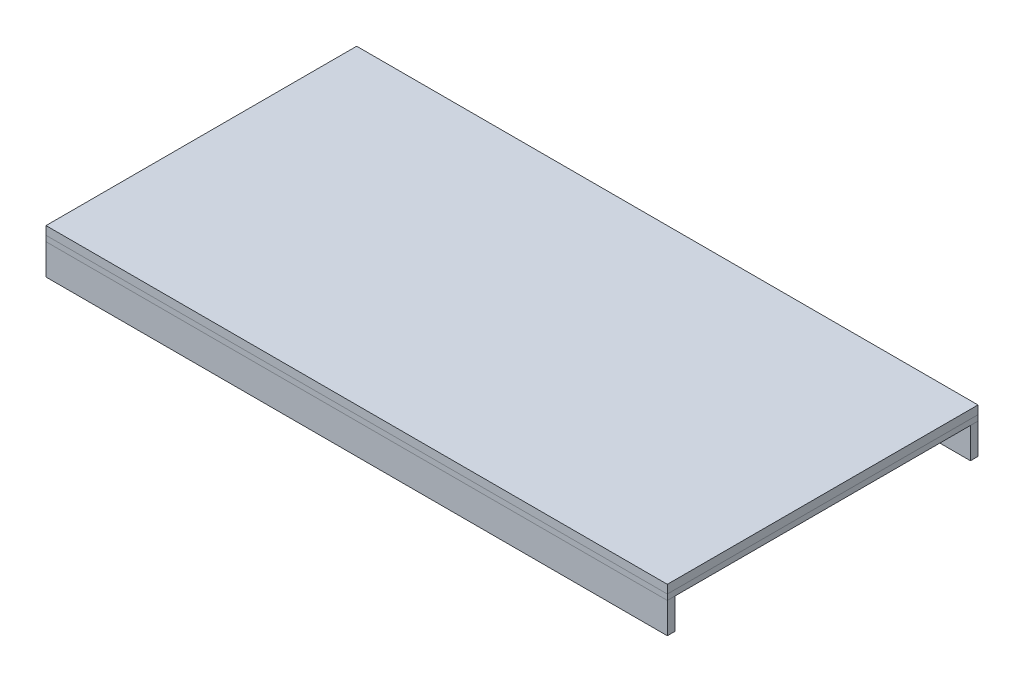
ISO-10303-21;
HEADER;
FILE_DESCRIPTION(('STEP AP214'),'2;1');
FILE_NAME('part.step','',(''),(''),'','','');
FILE_SCHEMA(('AUTOMOTIVE_DESIGN { 1 0 10303 214 1 1 1 1 }'));
ENDSEC;
DATA;
#1=APPLICATION_CONTEXT('core data for automotive mechanical design processes');
#2=APPLICATION_PROTOCOL_DEFINITION('international standard','automotive_design',2000,#1);
#3=PRODUCT_CONTEXT('',#1,'mechanical');
#4=PRODUCT('Part','Part','',(#3));
#5=PRODUCT_RELATED_PRODUCT_CATEGORY('part','',(#4));
#6=PRODUCT_DEFINITION_FORMATION('','',#4);
#7=PRODUCT_DEFINITION_CONTEXT('part definition',#1,'design');
#8=PRODUCT_DEFINITION('design','',#6,#7);
#9=PRODUCT_DEFINITION_SHAPE('','',#8);
#10=(LENGTH_UNIT() NAMED_UNIT(*) SI_UNIT(.MILLI.,.METRE.));
#11=(NAMED_UNIT(*) PLANE_ANGLE_UNIT() SI_UNIT($,.RADIAN.));
#12=(NAMED_UNIT(*) SI_UNIT($,.STERADIAN.) SOLID_ANGLE_UNIT());
#13=UNCERTAINTY_MEASURE_WITH_UNIT(LENGTH_MEASURE(1.E-05),#10,'distance_accuracy_value','');
#14=(GEOMETRIC_REPRESENTATION_CONTEXT(3) GLOBAL_UNCERTAINTY_ASSIGNED_CONTEXT((#13)) GLOBAL_UNIT_ASSIGNED_CONTEXT((#10,
#11,#12)) REPRESENTATION_CONTEXT('',''));
#15=CARTESIAN_POINT('',(0.,0.,0.));
#16=DIRECTION('',(0.,0.,1.));
#17=DIRECTION('',(1.,0.,0.));
#18=AXIS2_PLACEMENT_3D('',#15,#16,#17);
#19=CARTESIAN_POINT('',(-343.75,-100.5,-333.));
#20=DIRECTION('',(0.,0.,-1.));
#21=DIRECTION('',(-1.,0.,0.));
#22=AXIS2_PLACEMENT_3D('',#19,#20,#21);
#23=PLANE('',#22);
#24=DIRECTION('',(0.,1.,0.));
#25=VECTOR('',#24,1.);
#26=CARTESIAN_POINT('',(-343.75,-31.5,-333.));
#27=LINE('',#26,#25);
#28=CARTESIAN_POINT('',(-343.75,-100.5,-333.));
#29=VERTEX_POINT('',#28);
#30=CARTESIAN_POINT('',(-343.75,-31.5,-333.));
#31=VERTEX_POINT('',#30);
#32=EDGE_CURVE('E96',#29,#31,#27,.T.);
#33=ORIENTED_EDGE('',*,*,#32,.F.);
#34=DIRECTION('',(1.,0.,0.));
#35=VECTOR('',#34,1.);
#36=CARTESIAN_POINT('',(-343.75,-100.5,-333.));
#37=LINE('',#36,#35);
#38=CARTESIAN_POINT('',(-356.25,-100.5,-333.));
#39=VERTEX_POINT('',#38);
#40=EDGE_CURVE('E107',#39,#29,#37,.T.);
#41=ORIENTED_EDGE('',*,*,#40,.F.);
#42=DIRECTION('',(0.,-1.,0.));
#43=VECTOR('',#42,1.);
#44=CARTESIAN_POINT('',(-356.25,-31.5,-333.));
#45=LINE('',#44,#43);
#46=CARTESIAN_POINT('',(-356.25,-31.5,-333.));
#47=VERTEX_POINT('',#46);
#48=EDGE_CURVE('E98',#47,#39,#45,.T.);
#49=ORIENTED_EDGE('',*,*,#48,.F.);
#50=DIRECTION('',(-1.,0.,0.));
#51=VECTOR('',#50,1.);
#52=CARTESIAN_POINT('',(-343.75,-31.5,-333.));
#53=LINE('',#52,#51);
#54=EDGE_CURVE('E88',#31,#47,#53,.T.);
#55=ORIENTED_EDGE('',*,*,#54,.F.);
#56=EDGE_LOOP('',(#33,#41,#49,#55));
#57=FACE_BOUND('',#56,.T.);
#58=ADVANCED_FACE('F47',(#57),#23,.T.);
#59=CARTESIAN_POINT('',(-343.75,-100.5,403.12310603503));
#60=DIRECTION('',(0.,1.,0.));
#61=DIRECTION('',(-1.,0.,0.));
#62=AXIS2_PLACEMENT_3D('',#59,#60,#61);
#63=PLANE('',#62);
#64=DIRECTION('',(0.,0.,-1.));
#65=VECTOR('',#64,1.);
#66=CARTESIAN_POINT('',(-343.75,-100.5,403.12310603503));
#67=LINE('',#66,#65);
#68=CARTESIAN_POINT('',(-343.75,-100.5,333.));
#69=VERTEX_POINT('',#68);
#70=EDGE_CURVE('E101',#69,#29,#67,.T.);
#71=ORIENTED_EDGE('',*,*,#70,.F.);
#72=DIRECTION('',(-1.,0.,0.));
#73=VECTOR('',#72,1.);
#74=CARTESIAN_POINT('',(-343.75,-100.5,333.));
#75=LINE('',#74,#73);
#76=CARTESIAN_POINT('',(-356.25,-100.5,333.));
#77=VERTEX_POINT('',#76);
#78=EDGE_CURVE('E51',#69,#77,#75,.T.);
#79=ORIENTED_EDGE('',*,*,#78,.T.);
#80=DIRECTION('',(0.,0.,-1.));
#81=VECTOR('',#80,1.);
#82=CARTESIAN_POINT('',(-356.25,-100.5,403.12310603503));
#83=LINE('',#82,#81);
#84=EDGE_CURVE('E110',#77,#39,#83,.T.);
#85=ORIENTED_EDGE('',*,*,#84,.T.);
#86=ORIENTED_EDGE('',*,*,#40,.T.);
#87=EDGE_LOOP('',(#71,#79,#85,#86));
#88=FACE_BOUND('',#87,.T.);
#89=ADVANCED_FACE('F120',(#88),#63,.F.);
#90=CARTESIAN_POINT('',(-356.25,-31.5,403.12310603503));
#91=DIRECTION('',(1.,0.,0.));
#92=DIRECTION('',(0.,0.,-1.));
#93=AXIS2_PLACEMENT_3D('',#90,#91,#92);
#94=PLANE('',#93);
#95=ORIENTED_EDGE('',*,*,#84,.F.);
#96=DIRECTION('',(0.,1.,0.));
#97=VECTOR('',#96,1.);
#98=CARTESIAN_POINT('',(-356.25,-31.5,333.));
#99=LINE('',#98,#97);
#100=CARTESIAN_POINT('',(-356.25,-31.5,333.));
#101=VERTEX_POINT('',#100);
#102=EDGE_CURVE('E116',#77,#101,#99,.T.);
#103=ORIENTED_EDGE('',*,*,#102,.T.);
#104=DIRECTION('',(0.,0.,-1.));
#105=VECTOR('',#104,1.);
#106=CARTESIAN_POINT('',(-356.25,-31.5,403.12310603503));
#107=LINE('',#106,#105);
#108=EDGE_CURVE('E92',#101,#47,#107,.T.);
#109=ORIENTED_EDGE('',*,*,#108,.T.);
#110=ORIENTED_EDGE('',*,*,#48,.T.);
#111=EDGE_LOOP('',(#95,#103,#109,#110));
#112=FACE_BOUND('',#111,.T.);
#113=ADVANCED_FACE('F115',(#112),#94,.F.);
#114=CARTESIAN_POINT('',(-343.75,-31.5,403.12310603503));
#115=DIRECTION('',(0.,-1.,0.));
#116=DIRECTION('',(1.,0.,0.));
#117=AXIS2_PLACEMENT_3D('',#114,#115,#116);
#118=PLANE('',#117);
#119=ORIENTED_EDGE('',*,*,#108,.F.);
#120=DIRECTION('',(1.,0.,0.));
#121=VECTOR('',#120,1.);
#122=CARTESIAN_POINT('',(-343.75,-31.5,333.));
#123=LINE('',#122,#121);
#124=CARTESIAN_POINT('',(-343.75,-31.5,333.));
#125=VERTEX_POINT('',#124);
#126=EDGE_CURVE('E56',#101,#125,#123,.T.);
#127=ORIENTED_EDGE('',*,*,#126,.T.);
#128=DIRECTION('',(0.,0.,-1.));
#129=VECTOR('',#128,1.);
#130=CARTESIAN_POINT('',(-343.75,-31.5,403.12310603503));
#131=LINE('',#130,#129);
#132=EDGE_CURVE('E85',#125,#31,#131,.T.);
#133=ORIENTED_EDGE('',*,*,#132,.T.);
#134=ORIENTED_EDGE('',*,*,#54,.T.);
#135=EDGE_LOOP('',(#119,#127,#133,#134));
#136=FACE_BOUND('',#135,.T.);
#137=ADVANCED_FACE('F87',(#136),#118,.F.);
#138=CARTESIAN_POINT('',(-343.75,-31.5,403.12310603503));
#139=DIRECTION('',(-1.,0.,0.));
#140=DIRECTION('',(0.,0.,1.));
#141=AXIS2_PLACEMENT_3D('',#138,#139,#140);
#142=PLANE('',#141);
#143=ORIENTED_EDGE('',*,*,#132,.F.);
#144=DIRECTION('',(0.,-1.,0.));
#145=VECTOR('',#144,1.);
#146=CARTESIAN_POINT('',(-343.75,-31.5,333.));
#147=LINE('',#146,#145);
#148=EDGE_CURVE('E12',#125,#69,#147,.T.);
#149=ORIENTED_EDGE('',*,*,#148,.T.);
#150=ORIENTED_EDGE('',*,*,#70,.T.);
#151=ORIENTED_EDGE('',*,*,#32,.T.);
#152=EDGE_LOOP('',(#143,#149,#150,#151));
#153=FACE_BOUND('',#152,.T.);
#154=ADVANCED_FACE('F49',(#153),#142,.F.);
#155=CARTESIAN_POINT('',(-771.063352017759,-31.5,333.));
#156=DIRECTION('',(0.,0.,-1.));
#157=DIRECTION('',(-1.,0.,0.));
#158=AXIS2_PLACEMENT_3D('',#155,#156,#157);
#159=PLANE('',#158);
#160=ORIENTED_EDGE('',*,*,#126,.F.);
#161=ORIENTED_EDGE('',*,*,#102,.F.);
#162=ORIENTED_EDGE('',*,*,#78,.F.);
#163=ORIENTED_EDGE('',*,*,#148,.F.);
#164=EDGE_LOOP('',(#160,#161,#162,#163));
#165=FACE_BOUND('',#164,.T.);
#166=ADVANCED_FACE('F121',(#165),#159,.F.);
#167=CLOSED_SHELL('',(#58,#89,#113,#137,#154,#166));
#168=MANIFOLD_SOLID_BREP('B2',#167);
#169=CARTESIAN_POINT('',(343.75,-100.5,-333.));
#170=DIRECTION('',(0.,0.,1.));
#171=DIRECTION('',(1.,0.,0.));
#172=AXIS2_PLACEMENT_3D('',#169,#170,#171);
#173=PLANE('',#172);
#174=DIRECTION('',(0.,-1.,0.));
#175=VECTOR('',#174,1.);
#176=CARTESIAN_POINT('',(343.75,-31.5,-333.));
#177=LINE('',#176,#175);
#178=CARTESIAN_POINT('',(343.75,-31.5,-333.));
#179=VERTEX_POINT('',#178);
#180=CARTESIAN_POINT('',(343.75,-100.5,-333.));
#181=VERTEX_POINT('',#180);
#182=EDGE_CURVE('E229',#179,#181,#177,.T.);
#183=ORIENTED_EDGE('',*,*,#182,.F.);
#184=DIRECTION('',(-1.,0.,0.));
#185=VECTOR('',#184,1.);
#186=CARTESIAN_POINT('',(343.75,-31.5,-333.));
#187=LINE('',#186,#185);
#188=CARTESIAN_POINT('',(356.25,-31.5,-333.));
#189=VERTEX_POINT('',#188);
#190=EDGE_CURVE('E240',#189,#179,#187,.T.);
#191=ORIENTED_EDGE('',*,*,#190,.F.);
#192=DIRECTION('',(0.,1.,0.));
#193=VECTOR('',#192,1.);
#194=CARTESIAN_POINT('',(356.25,-31.5,-333.));
#195=LINE('',#194,#193);
#196=CARTESIAN_POINT('',(356.25,-100.5,-333.));
#197=VERTEX_POINT('',#196);
#198=EDGE_CURVE('E231',#197,#189,#195,.T.);
#199=ORIENTED_EDGE('',*,*,#198,.F.);
#200=DIRECTION('',(1.,0.,0.));
#201=VECTOR('',#200,1.);
#202=CARTESIAN_POINT('',(343.75,-100.5,-333.));
#203=LINE('',#202,#201);
#204=EDGE_CURVE('E221',#181,#197,#203,.T.);
#205=ORIENTED_EDGE('',*,*,#204,.F.);
#206=EDGE_LOOP('',(#183,#191,#199,#205));
#207=FACE_BOUND('',#206,.T.);
#208=ADVANCED_FACE('F180',(#207),#173,.F.);
#209=CARTESIAN_POINT('',(343.75,-31.5,403.12310603503));
#210=DIRECTION('',(0.,-1.,0.));
#211=DIRECTION('',(0.,0.,-1.));
#212=AXIS2_PLACEMENT_3D('',#209,#210,#211);
#213=PLANE('',#212);
#214=DIRECTION('',(0.,0.,-1.));
#215=VECTOR('',#214,1.);
#216=CARTESIAN_POINT('',(343.75,-31.5,403.12310603503));
#217=LINE('',#216,#215);
#218=CARTESIAN_POINT('',(343.75,-31.5,333.));
#219=VERTEX_POINT('',#218);
#220=EDGE_CURVE('E234',#219,#179,#217,.T.);
#221=ORIENTED_EDGE('',*,*,#220,.F.);
#222=DIRECTION('',(1.,0.,0.));
#223=VECTOR('',#222,1.);
#224=CARTESIAN_POINT('',(343.75,-31.5,333.));
#225=LINE('',#224,#223);
#226=CARTESIAN_POINT('',(356.25,-31.5,333.));
#227=VERTEX_POINT('',#226);
#228=EDGE_CURVE('E184',#219,#227,#225,.T.);
#229=ORIENTED_EDGE('',*,*,#228,.T.);
#230=DIRECTION('',(0.,0.,-1.));
#231=VECTOR('',#230,1.);
#232=CARTESIAN_POINT('',(356.25,-31.5,403.12310603503));
#233=LINE('',#232,#231);
#234=EDGE_CURVE('E243',#227,#189,#233,.T.);
#235=ORIENTED_EDGE('',*,*,#234,.T.);
#236=ORIENTED_EDGE('',*,*,#190,.T.);
#237=EDGE_LOOP('',(#221,#229,#235,#236));
#238=FACE_BOUND('',#237,.T.);
#239=ADVANCED_FACE('F253',(#238),#213,.F.);
#240=CARTESIAN_POINT('',(356.25,-31.5,403.12310603503));
#241=DIRECTION('',(-1.,0.,0.));
#242=DIRECTION('',(0.,-1.,0.));
#243=AXIS2_PLACEMENT_3D('',#240,#241,#242);
#244=PLANE('',#243);
#245=ORIENTED_EDGE('',*,*,#234,.F.);
#246=DIRECTION('',(0.,-1.,0.));
#247=VECTOR('',#246,1.);
#248=CARTESIAN_POINT('',(356.25,-31.5,333.));
#249=LINE('',#248,#247);
#250=CARTESIAN_POINT('',(356.25,-100.5,333.));
#251=VERTEX_POINT('',#250);
#252=EDGE_CURVE('E249',#227,#251,#249,.T.);
#253=ORIENTED_EDGE('',*,*,#252,.T.);
#254=DIRECTION('',(0.,0.,-1.));
#255=VECTOR('',#254,1.);
#256=CARTESIAN_POINT('',(356.25,-100.5,403.12310603503));
#257=LINE('',#256,#255);
#258=EDGE_CURVE('E225',#251,#197,#257,.T.);
#259=ORIENTED_EDGE('',*,*,#258,.T.);
#260=ORIENTED_EDGE('',*,*,#198,.T.);
#261=EDGE_LOOP('',(#245,#253,#259,#260));
#262=FACE_BOUND('',#261,.T.);
#263=ADVANCED_FACE('F248',(#262),#244,.F.);
#264=CARTESIAN_POINT('',(343.75,-100.5,403.12310603503));
#265=DIRECTION('',(0.,1.,0.));
#266=DIRECTION('',(0.,0.,1.));
#267=AXIS2_PLACEMENT_3D('',#264,#265,#266);
#268=PLANE('',#267);
#269=ORIENTED_EDGE('',*,*,#258,.F.);
#270=DIRECTION('',(-1.,0.,0.));
#271=VECTOR('',#270,1.);
#272=CARTESIAN_POINT('',(343.75,-100.5,333.));
#273=LINE('',#272,#271);
#274=CARTESIAN_POINT('',(343.75,-100.5,333.));
#275=VERTEX_POINT('',#274);
#276=EDGE_CURVE('E189',#251,#275,#273,.T.);
#277=ORIENTED_EDGE('',*,*,#276,.T.);
#278=DIRECTION('',(0.,0.,-1.));
#279=VECTOR('',#278,1.);
#280=CARTESIAN_POINT('',(343.75,-100.5,403.12310603503));
#281=LINE('',#280,#279);
#282=EDGE_CURVE('E218',#275,#181,#281,.T.);
#283=ORIENTED_EDGE('',*,*,#282,.T.);
#284=ORIENTED_EDGE('',*,*,#204,.T.);
#285=EDGE_LOOP('',(#269,#277,#283,#284));
#286=FACE_BOUND('',#285,.T.);
#287=ADVANCED_FACE('F220',(#286),#268,.F.);
#288=CARTESIAN_POINT('',(343.75,-31.5,403.12310603503));
#289=DIRECTION('',(1.,0.,0.));
#290=DIRECTION('',(0.,1.,0.));
#291=AXIS2_PLACEMENT_3D('',#288,#289,#290);
#292=PLANE('',#291);
#293=ORIENTED_EDGE('',*,*,#282,.F.);
#294=DIRECTION('',(0.,1.,0.));
#295=VECTOR('',#294,1.);
#296=CARTESIAN_POINT('',(343.75,-31.5,333.));
#297=LINE('',#296,#295);
#298=EDGE_CURVE('E45',#275,#219,#297,.T.);
#299=ORIENTED_EDGE('',*,*,#298,.T.);
#300=ORIENTED_EDGE('',*,*,#220,.T.);
#301=ORIENTED_EDGE('',*,*,#182,.T.);
#302=EDGE_LOOP('',(#293,#299,#300,#301));
#303=FACE_BOUND('',#302,.T.);
#304=ADVANCED_FACE('F182',(#303),#292,.F.);
#305=CARTESIAN_POINT('',(-771.063352017759,-31.5,333.));
#306=DIRECTION('',(0.,0.,-1.));
#307=DIRECTION('',(-1.,0.,0.));
#308=AXIS2_PLACEMENT_3D('',#305,#306,#307);
#309=PLANE('',#308);
#310=ORIENTED_EDGE('',*,*,#276,.F.);
#311=ORIENTED_EDGE('',*,*,#252,.F.);
#312=ORIENTED_EDGE('',*,*,#228,.F.);
#313=ORIENTED_EDGE('',*,*,#298,.F.);
#314=EDGE_LOOP('',(#310,#311,#312,#313));
#315=FACE_BOUND('',#314,.T.);
#316=ADVANCED_FACE('F254',(#315),#309,.F.);
#317=CLOSED_SHELL('',(#208,#239,#263,#287,#304,#316));
#318=MANIFOLD_SOLID_BREP('B6',#317);
#319=CARTESIAN_POINT('',(-6.24999999999999,-100.5,-333.));
#320=DIRECTION('',(0.,0.,1.));
#321=DIRECTION('',(1.,0.,0.));
#322=AXIS2_PLACEMENT_3D('',#319,#320,#321);
#323=PLANE('',#322);
#324=DIRECTION('',(0.,-1.,0.));
#325=VECTOR('',#324,1.);
#326=CARTESIAN_POINT('',(-6.25000000000003,-31.5,-333.));
#327=LINE('',#326,#325);
#328=CARTESIAN_POINT('',(-6.25000000000003,-31.5,-333.));
#329=VERTEX_POINT('',#328);
#330=CARTESIAN_POINT('',(-6.24999999999999,-100.5,-333.));
#331=VERTEX_POINT('',#330);
#332=EDGE_CURVE('E362',#329,#331,#327,.T.);
#333=ORIENTED_EDGE('',*,*,#332,.F.);
#334=DIRECTION('',(-1.,0.,0.));
#335=VECTOR('',#334,1.);
#336=CARTESIAN_POINT('',(-6.25000000000003,-31.5,-333.));
#337=LINE('',#336,#335);
#338=CARTESIAN_POINT('',(6.25,-31.5,-333.));
#339=VERTEX_POINT('',#338);
#340=EDGE_CURVE('E373',#339,#329,#337,.T.);
#341=ORIENTED_EDGE('',*,*,#340,.F.);
#342=DIRECTION('',(0.,1.,0.));
#343=VECTOR('',#342,1.);
#344=CARTESIAN_POINT('',(6.25,-31.5,-333.));
#345=LINE('',#344,#343);
#346=CARTESIAN_POINT('',(6.25000000000001,-100.5,-333.));
#347=VERTEX_POINT('',#346);
#348=EDGE_CURVE('E364',#347,#339,#345,.T.);
#349=ORIENTED_EDGE('',*,*,#348,.F.);
#350=DIRECTION('',(1.,0.,0.));
#351=VECTOR('',#350,1.);
#352=CARTESIAN_POINT('',(-6.24999999999999,-100.5,-333.));
#353=LINE('',#352,#351);
#354=EDGE_CURVE('E354',#331,#347,#353,.T.);
#355=ORIENTED_EDGE('',*,*,#354,.F.);
#356=EDGE_LOOP('',(#333,#341,#349,#355));
#357=FACE_BOUND('',#356,.T.);
#358=ADVANCED_FACE('F313',(#357),#323,.F.);
#359=CARTESIAN_POINT('',(-6.25000000000003,-31.5,403.12310603503));
#360=DIRECTION('',(0.,-1.,0.));
#361=DIRECTION('',(0.,0.,-1.));
#362=AXIS2_PLACEMENT_3D('',#359,#360,#361);
#363=PLANE('',#362);
#364=DIRECTION('',(0.,0.,-1.));
#365=VECTOR('',#364,1.);
#366=CARTESIAN_POINT('',(-6.25000000000003,-31.5,403.12310603503));
#367=LINE('',#366,#365);
#368=CARTESIAN_POINT('',(-6.25000000000003,-31.5,333.));
#369=VERTEX_POINT('',#368);
#370=EDGE_CURVE('E367',#369,#329,#367,.T.);
#371=ORIENTED_EDGE('',*,*,#370,.F.);
#372=DIRECTION('',(1.,0.,0.));
#373=VECTOR('',#372,1.);
#374=CARTESIAN_POINT('',(-6.25000000000004,-31.5,333.));
#375=LINE('',#374,#373);
#376=CARTESIAN_POINT('',(6.25,-31.5,333.));
#377=VERTEX_POINT('',#376);
#378=EDGE_CURVE('E317',#369,#377,#375,.T.);
#379=ORIENTED_EDGE('',*,*,#378,.T.);
#380=DIRECTION('',(0.,0.,-1.));
#381=VECTOR('',#380,1.);
#382=CARTESIAN_POINT('',(6.25,-31.5,403.12310603503));
#383=LINE('',#382,#381);
#384=EDGE_CURVE('E376',#377,#339,#383,.T.);
#385=ORIENTED_EDGE('',*,*,#384,.T.);
#386=ORIENTED_EDGE('',*,*,#340,.T.);
#387=EDGE_LOOP('',(#371,#379,#385,#386));
#388=FACE_BOUND('',#387,.T.);
#389=ADVANCED_FACE('F386',(#388),#363,.F.);
#390=CARTESIAN_POINT('',(6.25,-31.5,403.12310603503));
#391=DIRECTION('',(-1.,0.,0.));
#392=DIRECTION('',(0.,-1.,0.));
#393=AXIS2_PLACEMENT_3D('',#390,#391,#392);
#394=PLANE('',#393);
#395=ORIENTED_EDGE('',*,*,#384,.F.);
#396=DIRECTION('',(0.,-1.,0.));
#397=VECTOR('',#396,1.);
#398=CARTESIAN_POINT('',(6.25,-31.5,333.));
#399=LINE('',#398,#397);
#400=CARTESIAN_POINT('',(6.25000000000001,-100.5,333.));
#401=VERTEX_POINT('',#400);
#402=EDGE_CURVE('E382',#377,#401,#399,.T.);
#403=ORIENTED_EDGE('',*,*,#402,.T.);
#404=DIRECTION('',(0.,0.,-1.));
#405=VECTOR('',#404,1.);
#406=CARTESIAN_POINT('',(6.25000000000001,-100.5,403.12310603503));
#407=LINE('',#406,#405);
#408=EDGE_CURVE('E358',#401,#347,#407,.T.);
#409=ORIENTED_EDGE('',*,*,#408,.T.);
#410=ORIENTED_EDGE('',*,*,#348,.T.);
#411=EDGE_LOOP('',(#395,#403,#409,#410));
#412=FACE_BOUND('',#411,.T.);
#413=ADVANCED_FACE('F381',(#412),#394,.F.);
#414=CARTESIAN_POINT('',(-6.24999999999999,-100.5,403.12310603503));
#415=DIRECTION('',(0.,1.,0.));
#416=DIRECTION('',(0.,0.,1.));
#417=AXIS2_PLACEMENT_3D('',#414,#415,#416);
#418=PLANE('',#417);
#419=ORIENTED_EDGE('',*,*,#408,.F.);
#420=DIRECTION('',(-1.,0.,0.));
#421=VECTOR('',#420,1.);
#422=CARTESIAN_POINT('',(-6.25,-100.5,333.));
#423=LINE('',#422,#421);
#424=CARTESIAN_POINT('',(-6.24999999999999,-100.5,333.));
#425=VERTEX_POINT('',#424);
#426=EDGE_CURVE('E322',#401,#425,#423,.T.);
#427=ORIENTED_EDGE('',*,*,#426,.T.);
#428=DIRECTION('',(0.,0.,-1.));
#429=VECTOR('',#428,1.);
#430=CARTESIAN_POINT('',(-6.24999999999999,-100.5,403.12310603503));
#431=LINE('',#430,#429);
#432=EDGE_CURVE('E351',#425,#331,#431,.T.);
#433=ORIENTED_EDGE('',*,*,#432,.T.);
#434=ORIENTED_EDGE('',*,*,#354,.T.);
#435=EDGE_LOOP('',(#419,#427,#433,#434));
#436=FACE_BOUND('',#435,.T.);
#437=ADVANCED_FACE('F353',(#436),#418,.F.);
#438=CARTESIAN_POINT('',(-6.25000000000003,-31.5,403.12310603503));
#439=DIRECTION('',(1.,0.,0.));
#440=DIRECTION('',(0.,1.,0.));
#441=AXIS2_PLACEMENT_3D('',#438,#439,#440);
#442=PLANE('',#441);
#443=ORIENTED_EDGE('',*,*,#432,.F.);
#444=DIRECTION('',(0.,1.,0.));
#445=VECTOR('',#444,1.);
#446=CARTESIAN_POINT('',(-6.25000000000003,-31.5,333.));
#447=LINE('',#446,#445);
#448=EDGE_CURVE('E178',#425,#369,#447,.T.);
#449=ORIENTED_EDGE('',*,*,#448,.T.);
#450=ORIENTED_EDGE('',*,*,#370,.T.);
#451=ORIENTED_EDGE('',*,*,#332,.T.);
#452=EDGE_LOOP('',(#443,#449,#450,#451));
#453=FACE_BOUND('',#452,.T.);
#454=ADVANCED_FACE('F315',(#453),#442,.F.);
#455=CARTESIAN_POINT('',(-771.063352017759,-31.5,333.));
#456=DIRECTION('',(0.,0.,-1.));
#457=DIRECTION('',(-1.,0.,0.));
#458=AXIS2_PLACEMENT_3D('',#455,#456,#457);
#459=PLANE('',#458);
#460=ORIENTED_EDGE('',*,*,#426,.F.);
#461=ORIENTED_EDGE('',*,*,#402,.F.);
#462=ORIENTED_EDGE('',*,*,#378,.F.);
#463=ORIENTED_EDGE('',*,*,#448,.F.);
#464=EDGE_LOOP('',(#460,#461,#462,#463));
#465=FACE_BOUND('',#464,.T.);
#466=ADVANCED_FACE('F387',(#465),#459,.F.);
#467=CLOSED_SHELL('',(#358,#389,#413,#437,#454,#466));
#468=MANIFOLD_SOLID_BREP('B39',#467);
#469=CARTESIAN_POINT('',(-771.063352017759,-31.5,-350.));
#470=DIRECTION('',(0.,0.,-1.));
#471=DIRECTION('',(-1.,0.,0.));
#472=AXIS2_PLACEMENT_3D('',#469,#470,#471);
#473=PLANE('',#472);
#474=DIRECTION('',(0.,-1.,0.));
#475=VECTOR('',#474,1.);
#476=CARTESIAN_POINT('',(-700.,-31.5,-350.));
#477=LINE('',#476,#475);
#478=CARTESIAN_POINT('',(-700.,-31.5,-350.));
#479=VERTEX_POINT('',#478);
#480=CARTESIAN_POINT('',(-700.,-100.5,-350.));
#481=VERTEX_POINT('',#480);
#482=EDGE_CURVE('E454',#479,#481,#477,.T.);
#483=ORIENTED_EDGE('',*,*,#482,.F.);
#484=DIRECTION('',(1.,0.,0.));
#485=VECTOR('',#484,1.);
#486=CARTESIAN_POINT('',(-771.063352017759,-31.5,-350.));
#487=LINE('',#486,#485);
#488=CARTESIAN_POINT('',(700.,-31.5,-350.));
#489=VERTEX_POINT('',#488);
#490=EDGE_CURVE('E480',#479,#489,#487,.T.);
#491=ORIENTED_EDGE('',*,*,#490,.T.);
#492=DIRECTION('',(0.,1.,0.));
#493=VECTOR('',#492,1.);
#494=CARTESIAN_POINT('',(700.,-31.5,-350.));
#495=LINE('',#494,#493);
#496=CARTESIAN_POINT('',(700.,-100.5,-350.));
#497=VERTEX_POINT('',#496);
#498=EDGE_CURVE('E484',#497,#489,#495,.T.);
#499=ORIENTED_EDGE('',*,*,#498,.F.);
#500=DIRECTION('',(1.,0.,0.));
#501=VECTOR('',#500,1.);
#502=CARTESIAN_POINT('',(-771.063352017759,-100.5,-350.));
#503=LINE('',#502,#501);
#504=EDGE_CURVE('E506',#481,#497,#503,.T.);
#505=ORIENTED_EDGE('',*,*,#504,.F.);
#506=EDGE_LOOP('',(#483,#491,#499,#505));
#507=FACE_BOUND('',#506,.T.);
#508=ADVANCED_FACE('F446',(#507),#473,.T.);
#509=CARTESIAN_POINT('',(-771.063352017759,-100.5,-350.));
#510=DIRECTION('',(0.,-1.,0.));
#511=DIRECTION('',(0.,0.,-1.));
#512=AXIS2_PLACEMENT_3D('',#509,#510,#511);
#513=PLANE('',#512);
#514=DIRECTION('',(0.,0.,1.));
#515=VECTOR('',#514,1.);
#516=CARTESIAN_POINT('',(-700.,-100.5,-350.));
#517=LINE('',#516,#515);
#518=CARTESIAN_POINT('',(-700.,-100.5,-333.));
#519=VERTEX_POINT('',#518);
#520=EDGE_CURVE('E518',#481,#519,#517,.T.);
#521=ORIENTED_EDGE('',*,*,#520,.F.);
#522=ORIENTED_EDGE('',*,*,#504,.T.);
#523=DIRECTION('',(0.,0.,-1.));
#524=VECTOR('',#523,1.);
#525=CARTESIAN_POINT('',(700.,-100.5,-350.));
#526=LINE('',#525,#524);
#527=CARTESIAN_POINT('',(700.,-100.5,-333.));
#528=VERTEX_POINT('',#527);
#529=EDGE_CURVE('E488',#528,#497,#526,.T.);
#530=ORIENTED_EDGE('',*,*,#529,.F.);
#531=DIRECTION('',(1.,0.,0.));
#532=VECTOR('',#531,1.);
#533=CARTESIAN_POINT('',(-771.063352017759,-100.5,-333.));
#534=LINE('',#533,#532);
#535=EDGE_CURVE('E509',#519,#528,#534,.T.);
#536=ORIENTED_EDGE('',*,*,#535,.F.);
#537=EDGE_LOOP('',(#521,#522,#530,#536));
#538=FACE_BOUND('',#537,.T.);
#539=ADVANCED_FACE('F517',(#538),#513,.T.);
#540=CARTESIAN_POINT('',(-771.063352017759,-31.5,-333.));
#541=DIRECTION('',(0.,0.,1.));
#542=DIRECTION('',(1.,0.,0.));
#543=AXIS2_PLACEMENT_3D('',#540,#541,#542);
#544=PLANE('',#543);
#545=DIRECTION('',(0.,1.,0.));
#546=VECTOR('',#545,1.);
#547=CARTESIAN_POINT('',(-700.,-31.5,-333.));
#548=LINE('',#547,#546);
#549=CARTESIAN_POINT('',(-700.,-31.5,-333.));
#550=VERTEX_POINT('',#549);
#551=EDGE_CURVE('E508',#519,#550,#548,.T.);
#552=ORIENTED_EDGE('',*,*,#551,.F.);
#553=ORIENTED_EDGE('',*,*,#535,.T.);
#554=DIRECTION('',(0.,-1.,0.));
#555=VECTOR('',#554,1.);
#556=CARTESIAN_POINT('',(700.,-31.5,-333.));
#557=LINE('',#556,#555);
#558=CARTESIAN_POINT('',(700.,-31.5,-333.));
#559=VERTEX_POINT('',#558);
#560=EDGE_CURVE('E496',#559,#528,#557,.T.);
#561=ORIENTED_EDGE('',*,*,#560,.F.);
#562=DIRECTION('',(1.,0.,0.));
#563=VECTOR('',#562,1.);
#564=CARTESIAN_POINT('',(-771.063352017759,-31.5,-333.));
#565=LINE('',#564,#563);
#566=EDGE_CURVE('E487',#550,#559,#565,.T.);
#567=ORIENTED_EDGE('',*,*,#566,.F.);
#568=EDGE_LOOP('',(#552,#553,#561,#567));
#569=FACE_BOUND('',#568,.T.);
#570=ADVANCED_FACE('F514',(#569),#544,.T.);
#571=CARTESIAN_POINT('',(-771.063352017759,-31.5,-350.));
#572=DIRECTION('',(0.,1.,0.));
#573=DIRECTION('',(0.,0.,1.));
#574=AXIS2_PLACEMENT_3D('',#571,#572,#573);
#575=PLANE('',#574);
#576=DIRECTION('',(0.,0.,-1.));
#577=VECTOR('',#576,1.);
#578=CARTESIAN_POINT('',(-700.,-31.5,-350.));
#579=LINE('',#578,#577);
#580=EDGE_CURVE('E311',#550,#479,#579,.T.);
#581=ORIENTED_EDGE('',*,*,#580,.F.);
#582=ORIENTED_EDGE('',*,*,#566,.T.);
#583=DIRECTION('',(0.,0.,1.));
#584=VECTOR('',#583,1.);
#585=CARTESIAN_POINT('',(700.,-31.5,-350.));
#586=LINE('',#585,#584);
#587=EDGE_CURVE('E490',#489,#559,#586,.T.);
#588=ORIENTED_EDGE('',*,*,#587,.F.);
#589=ORIENTED_EDGE('',*,*,#490,.F.);
#590=EDGE_LOOP('',(#581,#582,#588,#589));
#591=FACE_BOUND('',#590,.T.);
#592=ADVANCED_FACE('F491',(#591),#575,.T.);
#593=CARTESIAN_POINT('',(700.,-100.5,-350.));
#594=DIRECTION('',(-1.,0.,0.));
#595=DIRECTION('',(0.,0.,1.));
#596=AXIS2_PLACEMENT_3D('',#593,#594,#595);
#597=PLANE('',#596);
#598=ORIENTED_EDGE('',*,*,#498,.T.);
#599=ORIENTED_EDGE('',*,*,#587,.T.);
#600=ORIENTED_EDGE('',*,*,#560,.T.);
#601=ORIENTED_EDGE('',*,*,#529,.T.);
#602=EDGE_LOOP('',(#598,#599,#600,#601));
#603=FACE_BOUND('',#602,.T.);
#604=ADVANCED_FACE('F498',(#603),#597,.F.);
#605=CARTESIAN_POINT('',(-700.,-31.5,350.));
#606=DIRECTION('',(1.,0.,0.));
#607=DIRECTION('',(0.,0.,-1.));
#608=AXIS2_PLACEMENT_3D('',#605,#606,#607);
#609=PLANE('',#608);
#610=ORIENTED_EDGE('',*,*,#482,.T.);
#611=ORIENTED_EDGE('',*,*,#520,.T.);
#612=ORIENTED_EDGE('',*,*,#551,.T.);
#613=ORIENTED_EDGE('',*,*,#580,.T.);
#614=EDGE_LOOP('',(#610,#611,#612,#613));
#615=FACE_BOUND('',#614,.T.);
#616=ADVANCED_FACE('F519',(#615),#609,.F.);
#617=CLOSED_SHELL('',(#508,#539,#570,#592,#604,#616));
#618=MANIFOLD_SOLID_BREP('B172',#617);
#619=CARTESIAN_POINT('',(-771.063352017759,-31.5,350.));
#620=DIRECTION('',(0.,0.,1.));
#621=DIRECTION('',(1.,0.,0.));
#622=AXIS2_PLACEMENT_3D('',#619,#620,#621);
#623=PLANE('',#622);
#624=DIRECTION('',(0.,1.,0.));
#625=VECTOR('',#624,1.);
#626=CARTESIAN_POINT('',(-700.,-31.5,350.));
#627=LINE('',#626,#625);
#628=CARTESIAN_POINT('',(-700.,-100.5,350.));
#629=VERTEX_POINT('',#628);
#630=CARTESIAN_POINT('',(-700.,-31.5,350.));
#631=VERTEX_POINT('',#630);
#632=EDGE_CURVE('E587',#629,#631,#627,.T.);
#633=ORIENTED_EDGE('',*,*,#632,.F.);
#634=DIRECTION('',(1.,0.,0.));
#635=VECTOR('',#634,1.);
#636=CARTESIAN_POINT('',(-771.063352017759,-100.5,350.));
#637=LINE('',#636,#635);
#638=CARTESIAN_POINT('',(700.,-100.5,350.));
#639=VERTEX_POINT('',#638);
#640=EDGE_CURVE('E613',#629,#639,#637,.T.);
#641=ORIENTED_EDGE('',*,*,#640,.T.);
#642=DIRECTION('',(0.,-1.,0.));
#643=VECTOR('',#642,1.);
#644=CARTESIAN_POINT('',(700.,-31.5,350.));
#645=LINE('',#644,#643);
#646=CARTESIAN_POINT('',(700.,-31.5,350.));
#647=VERTEX_POINT('',#646);
#648=EDGE_CURVE('E617',#647,#639,#645,.T.);
#649=ORIENTED_EDGE('',*,*,#648,.F.);
#650=DIRECTION('',(1.,0.,0.));
#651=VECTOR('',#650,1.);
#652=CARTESIAN_POINT('',(-771.063352017759,-31.5,350.));
#653=LINE('',#652,#651);
#654=EDGE_CURVE('E639',#631,#647,#653,.T.);
#655=ORIENTED_EDGE('',*,*,#654,.F.);
#656=EDGE_LOOP('',(#633,#641,#649,#655));
#657=FACE_BOUND('',#656,.T.);
#658=ADVANCED_FACE('F579',(#657),#623,.T.);
#659=CARTESIAN_POINT('',(-771.063352017759,-31.5,350.));
#660=DIRECTION('',(0.,1.,0.));
#661=DIRECTION('',(0.,0.,1.));
#662=AXIS2_PLACEMENT_3D('',#659,#660,#661);
#663=PLANE('',#662);
#664=DIRECTION('',(0.,0.,-1.));
#665=VECTOR('',#664,1.);
#666=CARTESIAN_POINT('',(-700.,-31.5,350.));
#667=LINE('',#666,#665);
#668=CARTESIAN_POINT('',(-700.,-31.5,333.));
#669=VERTEX_POINT('',#668);
#670=EDGE_CURVE('E651',#631,#669,#667,.T.);
#671=ORIENTED_EDGE('',*,*,#670,.F.);
#672=ORIENTED_EDGE('',*,*,#654,.T.);
#673=DIRECTION('',(0.,0.,1.));
#674=VECTOR('',#673,1.);
#675=CARTESIAN_POINT('',(700.,-31.5,350.));
#676=LINE('',#675,#674);
#677=CARTESIAN_POINT('',(700.,-31.5,333.));
#678=VERTEX_POINT('',#677);
#679=EDGE_CURVE('E621',#678,#647,#676,.T.);
#680=ORIENTED_EDGE('',*,*,#679,.F.);
#681=DIRECTION('',(1.,0.,0.));
#682=VECTOR('',#681,1.);
#683=CARTESIAN_POINT('',(-771.063352017759,-31.5,333.));
#684=LINE('',#683,#682);
#685=EDGE_CURVE('E642',#669,#678,#684,.T.);
#686=ORIENTED_EDGE('',*,*,#685,.F.);
#687=EDGE_LOOP('',(#671,#672,#680,#686));
#688=FACE_BOUND('',#687,.T.);
#689=ADVANCED_FACE('F650',(#688),#663,.T.);
#690=CARTESIAN_POINT('',(-771.063352017759,-31.5,333.));
#691=DIRECTION('',(0.,0.,-1.));
#692=DIRECTION('',(-1.,0.,0.));
#693=AXIS2_PLACEMENT_3D('',#690,#691,#692);
#694=PLANE('',#693);
#695=DIRECTION('',(0.,-1.,0.));
#696=VECTOR('',#695,1.);
#697=CARTESIAN_POINT('',(-700.,-31.5,333.));
#698=LINE('',#697,#696);
#699=CARTESIAN_POINT('',(-700.,-100.5,333.));
#700=VERTEX_POINT('',#699);
#701=EDGE_CURVE('E641',#669,#700,#698,.T.);
#702=ORIENTED_EDGE('',*,*,#701,.F.);
#703=ORIENTED_EDGE('',*,*,#685,.T.);
#704=DIRECTION('',(0.,1.,0.));
#705=VECTOR('',#704,1.);
#706=CARTESIAN_POINT('',(700.,-31.5,333.));
#707=LINE('',#706,#705);
#708=CARTESIAN_POINT('',(700.,-100.5,333.));
#709=VERTEX_POINT('',#708);
#710=EDGE_CURVE('E629',#709,#678,#707,.T.);
#711=ORIENTED_EDGE('',*,*,#710,.F.);
#712=DIRECTION('',(1.,0.,0.));
#713=VECTOR('',#712,1.);
#714=CARTESIAN_POINT('',(-771.063352017759,-100.5,333.));
#715=LINE('',#714,#713);
#716=EDGE_CURVE('E620',#700,#709,#715,.T.);
#717=ORIENTED_EDGE('',*,*,#716,.F.);
#718=EDGE_LOOP('',(#702,#703,#711,#717));
#719=FACE_BOUND('',#718,.T.);
#720=ADVANCED_FACE('F647',(#719),#694,.T.);
#721=CARTESIAN_POINT('',(-771.063352017759,-100.5,350.));
#722=DIRECTION('',(0.,-1.,0.));
#723=DIRECTION('',(0.,0.,-1.));
#724=AXIS2_PLACEMENT_3D('',#721,#722,#723);
#725=PLANE('',#724);
#726=DIRECTION('',(0.,0.,1.));
#727=VECTOR('',#726,1.);
#728=CARTESIAN_POINT('',(-700.,-100.5,350.));
#729=LINE('',#728,#727);
#730=EDGE_CURVE('E444',#700,#629,#729,.T.);
#731=ORIENTED_EDGE('',*,*,#730,.F.);
#732=ORIENTED_EDGE('',*,*,#716,.T.);
#733=DIRECTION('',(0.,0.,-1.));
#734=VECTOR('',#733,1.);
#735=CARTESIAN_POINT('',(700.,-100.5,350.));
#736=LINE('',#735,#734);
#737=EDGE_CURVE('E623',#639,#709,#736,.T.);
#738=ORIENTED_EDGE('',*,*,#737,.F.);
#739=ORIENTED_EDGE('',*,*,#640,.F.);
#740=EDGE_LOOP('',(#731,#732,#738,#739));
#741=FACE_BOUND('',#740,.T.);
#742=ADVANCED_FACE('F624',(#741),#725,.T.);
#743=CARTESIAN_POINT('',(700.,-100.5,350.));
#744=DIRECTION('',(1.,0.,0.));
#745=DIRECTION('',(0.,0.,-1.));
#746=AXIS2_PLACEMENT_3D('',#743,#744,#745);
#747=PLANE('',#746);
#748=ORIENTED_EDGE('',*,*,#648,.T.);
#749=ORIENTED_EDGE('',*,*,#737,.T.);
#750=ORIENTED_EDGE('',*,*,#710,.T.);
#751=ORIENTED_EDGE('',*,*,#679,.T.);
#752=EDGE_LOOP('',(#748,#749,#750,#751));
#753=FACE_BOUND('',#752,.T.);
#754=ADVANCED_FACE('F631',(#753),#747,.T.);
#755=CARTESIAN_POINT('',(-700.,-31.5,350.));
#756=DIRECTION('',(1.,0.,0.));
#757=DIRECTION('',(0.,0.,-1.));
#758=AXIS2_PLACEMENT_3D('',#755,#756,#757);
#759=PLANE('',#758);
#760=ORIENTED_EDGE('',*,*,#632,.T.);
#761=ORIENTED_EDGE('',*,*,#670,.T.);
#762=ORIENTED_EDGE('',*,*,#701,.T.);
#763=ORIENTED_EDGE('',*,*,#730,.T.);
#764=EDGE_LOOP('',(#760,#761,#762,#763));
#765=FACE_BOUND('',#764,.T.);
#766=ADVANCED_FACE('F652',(#765),#759,.F.);
#767=CLOSED_SHELL('',(#658,#689,#720,#742,#754,#766));
#768=MANIFOLD_SOLID_BREP('B305',#767);
#769=CARTESIAN_POINT('',(700.,-31.5,350.));
#770=DIRECTION('',(0.,0.,-1.));
#771=DIRECTION('',(-1.,0.,0.));
#772=AXIS2_PLACEMENT_3D('',#769,#770,#771);
#773=PLANE('',#772);
#774=DIRECTION('',(-1.,0.,0.));
#775=VECTOR('',#774,1.);
#776=CARTESIAN_POINT('',(700.,-19.,350.));
#777=LINE('',#776,#775);
#778=CARTESIAN_POINT('',(700.,-19.,350.));
#779=VERTEX_POINT('',#778);
#780=CARTESIAN_POINT('',(-700.,-19.,350.));
#781=VERTEX_POINT('',#780);
#782=EDGE_CURVE('E774',#779,#781,#777,.T.);
#783=ORIENTED_EDGE('',*,*,#782,.T.);
#784=DIRECTION('',(0.,1.,0.));
#785=VECTOR('',#784,1.);
#786=CARTESIAN_POINT('',(-700.,-31.5,350.));
#787=LINE('',#786,#785);
#788=CARTESIAN_POINT('',(-700.,-31.5,350.));
#789=VERTEX_POINT('',#788);
#790=EDGE_CURVE('E577',#789,#781,#787,.T.);
#791=ORIENTED_EDGE('',*,*,#790,.F.);
#792=DIRECTION('',(-1.,0.,0.));
#793=VECTOR('',#792,1.);
#794=CARTESIAN_POINT('',(700.,-31.5,350.));
#795=LINE('',#794,#793);
#796=CARTESIAN_POINT('',(700.,-31.5,350.));
#797=VERTEX_POINT('',#796);
#798=EDGE_CURVE('E762',#797,#789,#795,.T.);
#799=ORIENTED_EDGE('',*,*,#798,.F.);
#800=DIRECTION('',(0.,1.,0.));
#801=VECTOR('',#800,1.);
#802=CARTESIAN_POINT('',(700.,-31.5,350.));
#803=LINE('',#802,#801);
#804=EDGE_CURVE('E770',#797,#779,#803,.T.);
#805=ORIENTED_EDGE('',*,*,#804,.T.);
#806=EDGE_LOOP('',(#783,#791,#799,#805));
#807=FACE_BOUND('',#806,.T.);
#808=ADVANCED_FACE('F711',(#807),#773,.F.);
#809=CARTESIAN_POINT('',(-700.,-31.5,350.));
#810=DIRECTION('',(1.,0.,0.));
#811=DIRECTION('',(0.,0.,-1.));
#812=AXIS2_PLACEMENT_3D('',#809,#810,#811);
#813=PLANE('',#812);
#814=DIRECTION('',(0.,0.,-1.));
#815=VECTOR('',#814,1.);
#816=CARTESIAN_POINT('',(-700.,-19.,350.));
#817=LINE('',#816,#815);
#818=CARTESIAN_POINT('',(-700.,-19.,-350.));
#819=VERTEX_POINT('',#818);
#820=EDGE_CURVE('E766',#781,#819,#817,.T.);
#821=ORIENTED_EDGE('',*,*,#820,.T.);
#822=DIRECTION('',(0.,1.,0.));
#823=VECTOR('',#822,1.);
#824=CARTESIAN_POINT('',(-700.,-31.5,-350.));
#825=LINE('',#824,#823);
#826=CARTESIAN_POINT('',(-700.,-31.5,-350.));
#827=VERTEX_POINT('',#826);
#828=EDGE_CURVE('E719',#827,#819,#825,.T.);
#829=ORIENTED_EDGE('',*,*,#828,.F.);
#830=DIRECTION('',(0.,0.,-1.));
#831=VECTOR('',#830,1.);
#832=CARTESIAN_POINT('',(-700.,-31.5,350.));
#833=LINE('',#832,#831);
#834=EDGE_CURVE('E757',#789,#827,#833,.T.);
#835=ORIENTED_EDGE('',*,*,#834,.F.);
#836=ORIENTED_EDGE('',*,*,#790,.T.);
#837=EDGE_LOOP('',(#821,#829,#835,#836));
#838=FACE_BOUND('',#837,.T.);
#839=ADVANCED_FACE('F765',(#838),#813,.F.);
#840=CARTESIAN_POINT('',(-700.,-31.5,-350.));
#841=DIRECTION('',(0.,0.,1.));
#842=DIRECTION('',(1.,0.,0.));
#843=AXIS2_PLACEMENT_3D('',#840,#841,#842);
#844=PLANE('',#843);
#845=DIRECTION('',(1.,0.,0.));
#846=VECTOR('',#845,1.);
#847=CARTESIAN_POINT('',(-700.,-19.,-350.));
#848=LINE('',#847,#846);
#849=CARTESIAN_POINT('',(700.,-19.,-350.));
#850=VERTEX_POINT('',#849);
#851=EDGE_CURVE('E744',#819,#850,#848,.T.);
#852=ORIENTED_EDGE('',*,*,#851,.T.);
#853=DIRECTION('',(0.,1.,0.));
#854=VECTOR('',#853,1.);
#855=CARTESIAN_POINT('',(700.,-31.5,-350.));
#856=LINE('',#855,#854);
#857=CARTESIAN_POINT('',(700.,-31.5,-350.));
#858=VERTEX_POINT('',#857);
#859=EDGE_CURVE('E767',#858,#850,#856,.T.);
#860=ORIENTED_EDGE('',*,*,#859,.F.);
#861=DIRECTION('',(1.,0.,0.));
#862=VECTOR('',#861,1.);
#863=CARTESIAN_POINT('',(-700.,-31.5,-350.));
#864=LINE('',#863,#862);
#865=EDGE_CURVE('E760',#827,#858,#864,.T.);
#866=ORIENTED_EDGE('',*,*,#865,.F.);
#867=ORIENTED_EDGE('',*,*,#828,.T.);
#868=EDGE_LOOP('',(#852,#860,#866,#867));
#869=FACE_BOUND('',#868,.T.);
#870=ADVANCED_FACE('F768',(#869),#844,.F.);
#871=CARTESIAN_POINT('',(700.,-31.5,-350.));
#872=DIRECTION('',(-1.,0.,0.));
#873=DIRECTION('',(0.,0.,1.));
#874=AXIS2_PLACEMENT_3D('',#871,#872,#873);
#875=PLANE('',#874);
#876=DIRECTION('',(0.,0.,1.));
#877=VECTOR('',#876,1.);
#878=CARTESIAN_POINT('',(700.,-19.,-350.));
#879=LINE('',#878,#877);
#880=EDGE_CURVE('E750',#850,#779,#879,.T.);
#881=ORIENTED_EDGE('',*,*,#880,.T.);
#882=ORIENTED_EDGE('',*,*,#804,.F.);
#883=DIRECTION('',(0.,0.,1.));
#884=VECTOR('',#883,1.);
#885=CARTESIAN_POINT('',(700.,-31.5,-350.));
#886=LINE('',#885,#884);
#887=EDGE_CURVE('E727',#858,#797,#886,.T.);
#888=ORIENTED_EDGE('',*,*,#887,.F.);
#889=ORIENTED_EDGE('',*,*,#859,.T.);
#890=EDGE_LOOP('',(#881,#882,#888,#889));
#891=FACE_BOUND('',#890,.T.);
#892=ADVANCED_FACE('F781',(#891),#875,.F.);
#893=CARTESIAN_POINT('',(-700.,-31.5,350.));
#894=DIRECTION('',(0.,-1.,0.));
#895=DIRECTION('',(0.,0.,-1.));
#896=AXIS2_PLACEMENT_3D('',#893,#894,#895);
#897=PLANE('',#896);
#898=ORIENTED_EDGE('',*,*,#798,.T.);
#899=ORIENTED_EDGE('',*,*,#834,.T.);
#900=ORIENTED_EDGE('',*,*,#865,.T.);
#901=ORIENTED_EDGE('',*,*,#887,.T.);
#902=EDGE_LOOP('',(#898,#899,#900,#901));
#903=FACE_BOUND('',#902,.T.);
#904=ADVANCED_FACE('F758',(#903),#897,.T.);
#905=CARTESIAN_POINT('',(-700.,-19.,350.));
#906=DIRECTION('',(0.,-1.,0.));
#907=DIRECTION('',(0.,0.,-1.));
#908=AXIS2_PLACEMENT_3D('',#905,#906,#907);
#909=PLANE('',#908);
#910=ORIENTED_EDGE('',*,*,#782,.F.);
#911=ORIENTED_EDGE('',*,*,#880,.F.);
#912=ORIENTED_EDGE('',*,*,#851,.F.);
#913=ORIENTED_EDGE('',*,*,#820,.F.);
#914=EDGE_LOOP('',(#910,#911,#912,#913));
#915=FACE_BOUND('',#914,.T.);
#916=ADVANCED_FACE('F784',(#915),#909,.F.);
#917=CLOSED_SHELL('',(#808,#839,#870,#892,#904,#916));
#918=MANIFOLD_SOLID_BREP('B438',#917);
#919=CARTESIAN_POINT('',(-700.,-19.,-350.));
#920=DIRECTION('',(-1.,0.,0.));
#921=DIRECTION('',(0.,0.,1.));
#922=AXIS2_PLACEMENT_3D('',#919,#920,#921);
#923=PLANE('',#922);
#924=DIRECTION('',(0.,0.,1.));
#925=VECTOR('',#924,1.);
#926=CARTESIAN_POINT('',(-700.,0.,-350.));
#927=LINE('',#926,#925);
#928=CARTESIAN_POINT('',(-700.,0.,-350.));
#929=VERTEX_POINT('',#928);
#930=CARTESIAN_POINT('',(-700.,0.,350.));
#931=VERTEX_POINT('',#930);
#932=EDGE_CURVE('E898',#929,#931,#927,.T.);
#933=ORIENTED_EDGE('',*,*,#932,.F.);
#934=DIRECTION('',(0.,1.,0.));
#935=VECTOR('',#934,1.);
#936=CARTESIAN_POINT('',(-700.,-19.,-350.));
#937=LINE('',#936,#935);
#938=CARTESIAN_POINT('',(-700.,-19.,-350.));
#939=VERTEX_POINT('',#938);
#940=EDGE_CURVE('E709',#939,#929,#937,.T.);
#941=ORIENTED_EDGE('',*,*,#940,.F.);
#942=DIRECTION('',(0.,0.,1.));
#943=VECTOR('',#942,1.);
#944=CARTESIAN_POINT('',(-700.,-19.,-350.));
#945=LINE('',#944,#943);
#946=CARTESIAN_POINT('',(-700.,-19.,350.));
#947=VERTEX_POINT('',#946);
#948=EDGE_CURVE('E892',#939,#947,#945,.T.);
#949=ORIENTED_EDGE('',*,*,#948,.T.);
#950=DIRECTION('',(0.,1.,0.));
#951=VECTOR('',#950,1.);
#952=CARTESIAN_POINT('',(-700.,-19.,350.));
#953=LINE('',#952,#951);
#954=EDGE_CURVE('E837',#947,#931,#953,.T.);
#955=ORIENTED_EDGE('',*,*,#954,.T.);
#956=EDGE_LOOP('',(#933,#941,#949,#955));
#957=FACE_BOUND('',#956,.T.);
#958=ADVANCED_FACE('F834',(#957),#923,.T.);
#959=CARTESIAN_POINT('',(-700.,-19.,-350.));
#960=DIRECTION('',(0.,0.,-1.));
#961=DIRECTION('',(-1.,0.,0.));
#962=AXIS2_PLACEMENT_3D('',#959,#960,#961);
#963=PLANE('',#962);
#964=DIRECTION('',(-1.,0.,0.));
#965=VECTOR('',#964,1.);
#966=CARTESIAN_POINT('',(-700.,0.,-350.));
#967=LINE('',#966,#965);
#968=CARTESIAN_POINT('',(700.,0.,-350.));
#969=VERTEX_POINT('',#968);
#970=EDGE_CURVE('E894',#969,#929,#967,.T.);
#971=ORIENTED_EDGE('',*,*,#970,.F.);
#972=DIRECTION('',(0.,1.,0.));
#973=VECTOR('',#972,1.);
#974=CARTESIAN_POINT('',(700.,-19.,-350.));
#975=LINE('',#974,#973);
#976=CARTESIAN_POINT('',(700.,-19.,-350.));
#977=VERTEX_POINT('',#976);
#978=EDGE_CURVE('E843',#977,#969,#975,.T.);
#979=ORIENTED_EDGE('',*,*,#978,.F.);
#980=DIRECTION('',(-1.,0.,0.));
#981=VECTOR('',#980,1.);
#982=CARTESIAN_POINT('',(-700.,-19.,-350.));
#983=LINE('',#982,#981);
#984=EDGE_CURVE('E889',#977,#939,#983,.T.);
#985=ORIENTED_EDGE('',*,*,#984,.T.);
#986=ORIENTED_EDGE('',*,*,#940,.T.);
#987=EDGE_LOOP('',(#971,#979,#985,#986));
#988=FACE_BOUND('',#987,.T.);
#989=ADVANCED_FACE('F908',(#988),#963,.T.);
#990=CARTESIAN_POINT('',(700.,-19.,-350.));
#991=DIRECTION('',(1.,0.,0.));
#992=DIRECTION('',(0.,0.,-1.));
#993=AXIS2_PLACEMENT_3D('',#990,#991,#992);
#994=PLANE('',#993);
#995=DIRECTION('',(0.,0.,-1.));
#996=VECTOR('',#995,1.);
#997=CARTESIAN_POINT('',(700.,0.,-350.));
#998=LINE('',#997,#996);
#999=CARTESIAN_POINT('',(700.,0.,350.));
#1000=VERTEX_POINT('',#999);
#1001=EDGE_CURVE('E884',#1000,#969,#998,.T.);
#1002=ORIENTED_EDGE('',*,*,#1001,.F.);
#1003=DIRECTION('',(0.,1.,0.));
#1004=VECTOR('',#1003,1.);
#1005=CARTESIAN_POINT('',(700.,-19.,350.));
#1006=LINE('',#1005,#1004);
#1007=CARTESIAN_POINT('',(700.,-19.,350.));
#1008=VERTEX_POINT('',#1007);
#1009=EDGE_CURVE('E879',#1008,#1000,#1006,.T.);
#1010=ORIENTED_EDGE('',*,*,#1009,.F.);
#1011=DIRECTION('',(0.,0.,-1.));
#1012=VECTOR('',#1011,1.);
#1013=CARTESIAN_POINT('',(700.,-19.,-350.));
#1014=LINE('',#1013,#1012);
#1015=EDGE_CURVE('E882',#1008,#977,#1014,.T.);
#1016=ORIENTED_EDGE('',*,*,#1015,.T.);
#1017=ORIENTED_EDGE('',*,*,#978,.T.);
#1018=EDGE_LOOP('',(#1002,#1010,#1016,#1017));
#1019=FACE_BOUND('',#1018,.T.);
#1020=ADVANCED_FACE('F881',(#1019),#994,.T.);
#1021=CARTESIAN_POINT('',(-700.,-19.,350.));
#1022=DIRECTION('',(0.,0.,1.));
#1023=DIRECTION('',(1.,0.,0.));
#1024=AXIS2_PLACEMENT_3D('',#1021,#1022,#1023);
#1025=PLANE('',#1024);
#1026=DIRECTION('',(1.,0.,0.));
#1027=VECTOR('',#1026,1.);
#1028=CARTESIAN_POINT('',(-700.,0.,350.));
#1029=LINE('',#1028,#1027);
#1030=EDGE_CURVE('E901',#931,#1000,#1029,.T.);
#1031=ORIENTED_EDGE('',*,*,#1030,.F.);
#1032=ORIENTED_EDGE('',*,*,#954,.F.);
#1033=DIRECTION('',(1.,0.,0.));
#1034=VECTOR('',#1033,1.);
#1035=CARTESIAN_POINT('',(-700.,-19.,350.));
#1036=LINE('',#1035,#1034);
#1037=EDGE_CURVE('E888',#947,#1008,#1036,.T.);
#1038=ORIENTED_EDGE('',*,*,#1037,.T.);
#1039=ORIENTED_EDGE('',*,*,#1009,.T.);
#1040=EDGE_LOOP('',(#1031,#1032,#1038,#1039));
#1041=FACE_BOUND('',#1040,.T.);
#1042=ADVANCED_FACE('F891',(#1041),#1025,.T.);
#1043=CARTESIAN_POINT('',(-700.,-19.,350.));
#1044=DIRECTION('',(0.,1.,0.));
#1045=DIRECTION('',(0.,0.,1.));
#1046=AXIS2_PLACEMENT_3D('',#1043,#1044,#1045);
#1047=PLANE('',#1046);
#1048=ORIENTED_EDGE('',*,*,#948,.F.);
#1049=ORIENTED_EDGE('',*,*,#984,.F.);
#1050=ORIENTED_EDGE('',*,*,#1015,.F.);
#1051=ORIENTED_EDGE('',*,*,#1037,.F.);
#1052=EDGE_LOOP('',(#1048,#1049,#1050,#1051));
#1053=FACE_BOUND('',#1052,.T.);
#1054=ADVANCED_FACE('F887',(#1053),#1047,.F.);
#1055=CARTESIAN_POINT('',(-700.,0.,350.));
#1056=DIRECTION('',(0.,1.,0.));
#1057=DIRECTION('',(0.,0.,1.));
#1058=AXIS2_PLACEMENT_3D('',#1055,#1056,#1057);
#1059=PLANE('',#1058);
#1060=ORIENTED_EDGE('',*,*,#932,.T.);
#1061=ORIENTED_EDGE('',*,*,#1030,.T.);
#1062=ORIENTED_EDGE('',*,*,#1001,.T.);
#1063=ORIENTED_EDGE('',*,*,#970,.T.);
#1064=EDGE_LOOP('',(#1060,#1061,#1062,#1063));
#1065=FACE_BOUND('',#1064,.T.);
#1066=ADVANCED_FACE('F907',(#1065),#1059,.T.);
#1067=CLOSED_SHELL('',(#958,#989,#1020,#1042,#1054,#1066));
#1068=MANIFOLD_SOLID_BREP('B571',#1067);
#1069=ADVANCED_BREP_SHAPE_REPRESENTATION('',(#18,#168,#318,#468,#618,#768,#918,#1068),#14);
#1070=SHAPE_DEFINITION_REPRESENTATION(#9,#1069);
ENDSEC;
END-ISO-10303-21;
